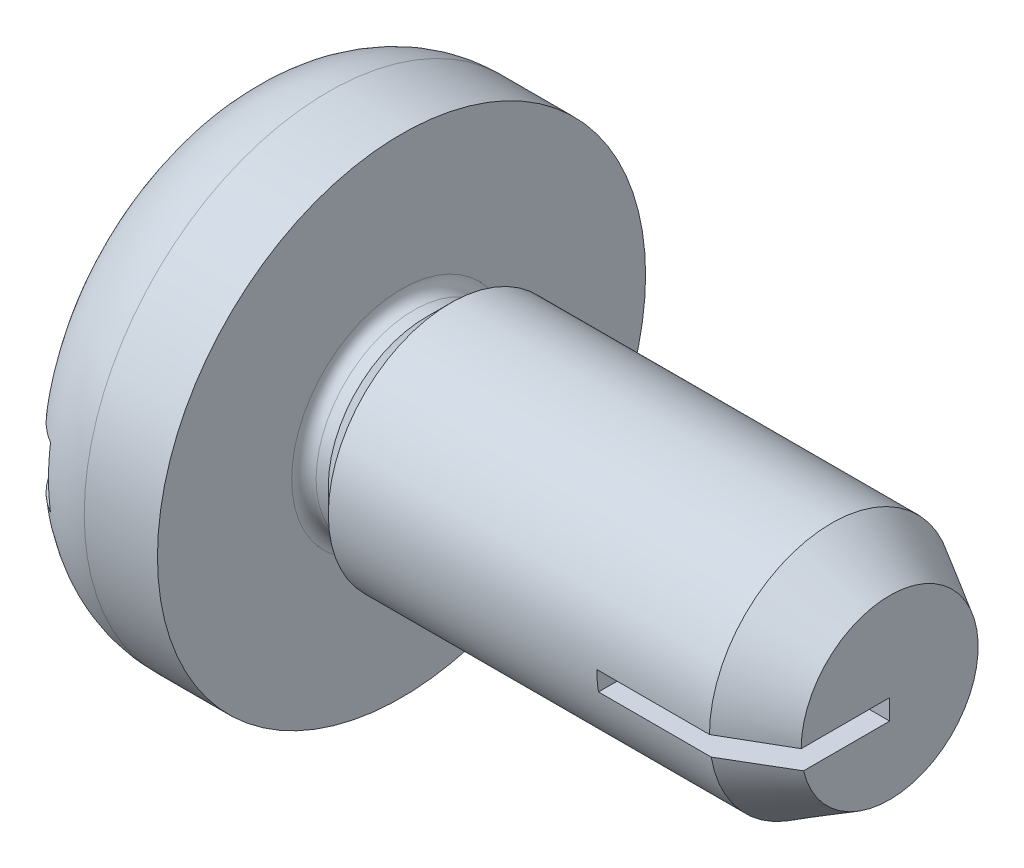
ISO-10303-21;
HEADER;
FILE_DESCRIPTION(('STEP AP214'),'2;1');
FILE_NAME('part.step','',(''),(''),'','','');
FILE_SCHEMA(('AUTOMOTIVE_DESIGN { 1 0 10303 214 1 1 1 1 }'));
ENDSEC;
DATA;
#1=APPLICATION_CONTEXT('core data for automotive mechanical design processes');
#2=APPLICATION_PROTOCOL_DEFINITION('international standard','automotive_design',2000,#1);
#3=PRODUCT_CONTEXT('',#1,'mechanical');
#4=PRODUCT('Part','Part','',(#3));
#5=PRODUCT_RELATED_PRODUCT_CATEGORY('part','',(#4));
#6=PRODUCT_DEFINITION_FORMATION('','',#4);
#7=PRODUCT_DEFINITION_CONTEXT('part definition',#1,'design');
#8=PRODUCT_DEFINITION('design','',#6,#7);
#9=PRODUCT_DEFINITION_SHAPE('','',#8);
#10=(LENGTH_UNIT() NAMED_UNIT(*) SI_UNIT(.MILLI.,.METRE.));
#11=(NAMED_UNIT(*) PLANE_ANGLE_UNIT() SI_UNIT($,.RADIAN.));
#12=(NAMED_UNIT(*) SI_UNIT($,.STERADIAN.) SOLID_ANGLE_UNIT());
#13=UNCERTAINTY_MEASURE_WITH_UNIT(LENGTH_MEASURE(1.E-05),#10,'distance_accuracy_value','');
#14=(GEOMETRIC_REPRESENTATION_CONTEXT(3) GLOBAL_UNCERTAINTY_ASSIGNED_CONTEXT((#13)) GLOBAL_UNIT_ASSIGNED_CONTEXT((#10,
#11,#12)) REPRESENTATION_CONTEXT('',''));
#15=CARTESIAN_POINT('',(0.,0.,0.));
#16=DIRECTION('',(0.,0.,1.));
#17=DIRECTION('',(1.,0.,0.));
#18=AXIS2_PLACEMENT_3D('',#15,#16,#17);
#19=CARTESIAN_POINT('',(0.,0.,0.));
#20=DIRECTION('',(-1.,0.,0.));
#21=DIRECTION('',(0.,0.,1.));
#22=AXIS2_PLACEMENT_3D('',#19,#20,#21);
#23=CYLINDRICAL_SURFACE('',#22,1.);
#24=CARTESIAN_POINT('',(1.8,0.,0.));
#25=DIRECTION('',(-1.,0.,0.));
#26=DIRECTION('',(0.,0.,1.));
#27=AXIS2_PLACEMENT_3D('',#24,#25,#26);
#28=CIRCLE('',#27,1.);
#29=CARTESIAN_POINT('',(1.8,0.,1.));
#30=VERTEX_POINT('',#29);
#31=EDGE_CURVE('E172',#30,#30,#28,.T.);
#32=ORIENTED_EDGE('',*,*,#31,.F.);
#33=EDGE_LOOP('',(#32));
#34=FACE_BOUND('',#33,.T.);
#35=DIRECTION('',(-1.,0.,0.));
#36=VECTOR('',#35,1.);
#37=CARTESIAN_POINT('',(0.,0.,1.));
#38=LINE('',#37,#36);
#39=CARTESIAN_POINT('',(4.92368602791855,0.,1.));
#40=VERTEX_POINT('',#39);
#41=CARTESIAN_POINT('',(4.,0.,1.));
#42=VERTEX_POINT('',#41);
#43=EDGE_CURVE('E257',#40,#42,#38,.T.);
#44=ORIENTED_EDGE('',*,*,#43,.F.);
#45=CARTESIAN_POINT('',(4.92368602791855,0.,0.));
#46=DIRECTION('',(-1.,0.,0.));
#47=DIRECTION('',(0.,0.,1.));
#48=AXIS2_PLACEMENT_3D('',#45,#46,#47);
#49=CIRCLE('',#48,1.);
#50=CARTESIAN_POINT('',(4.92368602791855,-0.166666666666667,0.98601329718327));
#51=VERTEX_POINT('',#50);
#52=EDGE_CURVE('E254',#40,#51,#49,.T.);
#53=ORIENTED_EDGE('',*,*,#52,.T.);
#54=DIRECTION('',(-1.,0.,0.));
#55=VECTOR('',#54,1.);
#56=CARTESIAN_POINT('',(0.,-0.166666666666667,0.98601329718327));
#57=LINE('',#56,#55);
#58=CARTESIAN_POINT('',(4.,-0.166666666666667,0.98601329718327));
#59=VERTEX_POINT('',#58);
#60=EDGE_CURVE('E261',#59,#51,#57,.F.);
#61=ORIENTED_EDGE('',*,*,#60,.F.);
#62=CARTESIAN_POINT('',(4.,0.,0.));
#63=DIRECTION('',(1.,0.,0.));
#64=DIRECTION('',(0.,0.,-1.));
#65=AXIS2_PLACEMENT_3D('',#62,#63,#64);
#66=CIRCLE('',#65,1.);
#67=EDGE_CURVE('E43',#42,#59,#66,.T.);
#68=ORIENTED_EDGE('',*,*,#67,.F.);
#69=EDGE_LOOP('',(#44,#53,#61,#68));
#70=FACE_BOUND('',#69,.T.);
#71=ADVANCED_FACE('F70',(#34,#70),#23,.T.);
#72=CARTESIAN_POINT('',(4.92368602791855,0.,0.));
#73=DIRECTION('',(-1.,0.,0.));
#74=DIRECTION('',(0.,0.,1.));
#75=AXIS2_PLACEMENT_3D('',#72,#73,#74);
#76=CONICAL_SURFACE('',#75,1.,0.523598775598292);
#77=ORIENTED_EDGE('',*,*,#52,.F.);
#78=DIRECTION('',(-0.866025403784442,0.,0.499999999999994));
#79=VECTOR('',#78,1.);
#80=CARTESIAN_POINT('',(6.65573683548745,0.,0.));
#81=LINE('',#80,#79);
#82=CARTESIAN_POINT('',(5.4,0.,0.725));
#83=VERTEX_POINT('',#82);
#84=EDGE_CURVE('E259',#40,#83,#81,.F.);
#85=ORIENTED_EDGE('',*,*,#84,.T.);
#86=CARTESIAN_POINT('',(5.4,0.,0.));
#87=DIRECTION('',(-1.,0.,0.));
#88=DIRECTION('',(0.,0.,1.));
#89=AXIS2_PLACEMENT_3D('',#86,#87,#88);
#90=CIRCLE('',#89,0.725);
#91=CARTESIAN_POINT('',(5.4,-0.166666666666667,0.705582895358315));
#92=VERTEX_POINT('',#91);
#93=EDGE_CURVE('E159',#83,#92,#90,.T.);
#94=ORIENTED_EDGE('',*,*,#93,.T.);
#95=CARTESIAN_POINT('',(6.20158381332156,-0.166666666666667,0.202420053526557));
#96=CARTESIAN_POINT('',(6.18988783202904,-0.166666666666667,0.211160466548662));
#97=CARTESIAN_POINT('',(6.17809025351935,-0.166666666666667,0.219762178615645));
#98=CARTESIAN_POINT('',(6.15433894019539,-0.166666666666667,0.236744395333112));
#99=CARTESIAN_POINT('',(6.14238522545202,-0.166666666666667,0.24512492800532));
#100=CARTESIAN_POINT('',(6.10636354341486,-0.166666666666667,0.27001702074862));
#101=CARTESIAN_POINT('',(6.08212753980992,-0.166666666666667,0.286284562967419));
#102=CARTESIAN_POINT('',(6.03340179258793,-0.166666666666667,0.318405310598194));
#103=CARTESIAN_POINT('',(6.00891218022306,-0.166666666666667,0.334258716708567));
#104=CARTESIAN_POINT('',(5.95975519749879,-0.166666666666667,0.365692570195777));
#105=CARTESIAN_POINT('',(5.93508780915903,-0.166666666666667,0.381272989399869));
#106=CARTESIAN_POINT('',(5.86393910946449,-0.166666666666667,0.425830715171768));
#107=CARTESIAN_POINT('',(5.81730791747779,-0.166666666666667,0.454568202998024));
#108=CARTESIAN_POINT('',(5.72381363437533,-0.166666666666667,0.511663876308538));
#109=CARTESIAN_POINT('',(5.67695053810779,-0.166666666666667,0.540022053314042));
#110=CARTESIAN_POINT('',(5.53610967036876,-0.166666666666667,0.624768530387811));
#111=CARTESIAN_POINT('',(5.44192005634867,-0.166666666666667,0.680804321809171));
#112=CARTESIAN_POINT('',(5.20311464815558,-0.166666666666667,0.822157213235217));
#113=CARTESIAN_POINT('',(5.0583320552326,-0.166666666666667,0.907191272129434));
#114=CARTESIAN_POINT('',(4.8410388744482,-0.166666666666667,1.03439645779868));
#115=CARTESIAN_POINT('',(4.76861884543354,-0.166666666666667,1.07672255711247));
#116=CARTESIAN_POINT('',(4.62373306050023,-0.166666666666667,1.16129606629588));
#117=CARTESIAN_POINT('',(4.55126730468176,-0.166666666666667,1.2035434763371));
#118=CARTESIAN_POINT('',(4.47878578161591,-0.166666666666667,1.24576382962675));
#119=B_SPLINE_CURVE_WITH_KNOTS('',3,(#95,#96,#97,#98,#99,#100,#101,#102,#103,#104,#105,#106,
#107,#108,#109,#110,#111,#112,#113,#114,#115,#116,#117,#118),.UNSPECIFIED.,.F.,.F.,(4,2,2,2,2,2,
2,2,2,2,2,4),(0.,0.0437997583052362,0.0875939406187669,0.175154441441493,0.262671690481115,
0.35019791888352,0.514519420031464,0.678844588147894,1.00763489196675,1.51135489439912,
1.7630003291903,2.01464521454735),.UNSPECIFIED.);
#120=EDGE_CURVE('E263',#92,#51,#119,.T.);
#121=ORIENTED_EDGE('',*,*,#120,.T.);
#122=EDGE_LOOP('',(#77,#85,#94,#121));
#123=FACE_BOUND('',#122,.T.);
#124=ADVANCED_FACE('F219',(#123),#76,.T.);
#125=CARTESIAN_POINT('',(5.4,1.,0.));
#126=DIRECTION('',(-1.,0.,0.));
#127=DIRECTION('',(0.,0.,1.));
#128=AXIS2_PLACEMENT_3D('',#125,#126,#127);
#129=PLANE('',#128);
#130=DIRECTION('',(0.,0.,1.));
#131=VECTOR('',#130,1.);
#132=CARTESIAN_POINT('',(5.4,0.,0.));
#133=LINE('',#132,#131);
#134=CARTESIAN_POINT('',(5.4,0.,0.));
#135=VERTEX_POINT('',#134);
#136=EDGE_CURVE('E78',#135,#83,#133,.T.);
#137=ORIENTED_EDGE('',*,*,#136,.F.);
#138=DIRECTION('',(0.,1.,0.));
#139=VECTOR('',#138,1.);
#140=CARTESIAN_POINT('',(5.4,0.,0.));
#141=LINE('',#140,#139);
#142=CARTESIAN_POINT('',(5.4,-0.166666666666667,0.));
#143=VERTEX_POINT('',#142);
#144=EDGE_CURVE('E150',#143,#135,#141,.T.);
#145=ORIENTED_EDGE('',*,*,#144,.F.);
#146=DIRECTION('',(0.,0.,-1.));
#147=VECTOR('',#146,1.);
#148=CARTESIAN_POINT('',(5.4,-0.166666666666667,0.));
#149=LINE('',#148,#147);
#150=EDGE_CURVE('E160',#92,#143,#149,.T.);
#151=ORIENTED_EDGE('',*,*,#150,.F.);
#152=ORIENTED_EDGE('',*,*,#93,.F.);
#153=EDGE_LOOP('',(#137,#145,#151,#152));
#154=FACE_BOUND('',#153,.T.);
#155=ADVANCED_FACE('F72',(#154),#129,.F.);
#156=CARTESIAN_POINT('',(0.,0.,0.));
#157=DIRECTION('',(1.,0.,0.));
#158=DIRECTION('',(0.,0.,-1.));
#159=AXIS2_PLACEMENT_3D('',#156,#157,#158);
#160=PLANE('',#159);
#161=CARTESIAN_POINT('',(0.,0.,0.));
#162=DIRECTION('',(-1.,0.,0.));
#163=DIRECTION('',(0.,0.,1.));
#164=AXIS2_PLACEMENT_3D('',#161,#162,#163);
#165=CIRCLE('',#164,1.2);
#166=CARTESIAN_POINT('',(0.,0.25,1.17366945943055));
#167=VERTEX_POINT('',#166);
#168=CARTESIAN_POINT('',(0.,0.25,-1.17366945943055));
#169=VERTEX_POINT('',#168);
#170=EDGE_CURVE('E190',#167,#169,#165,.T.);
#171=ORIENTED_EDGE('',*,*,#170,.T.);
#172=DIRECTION('',(0.,0.,1.));
#173=VECTOR('',#172,1.);
#174=CARTESIAN_POINT('',(0.,0.25,0.));
#175=LINE('',#174,#173);
#176=EDGE_CURVE('E167',#169,#167,#175,.T.);
#177=ORIENTED_EDGE('',*,*,#176,.T.);
#178=EDGE_LOOP('',(#171,#177));
#179=FACE_BOUND('',#178,.T.);
#180=ADVANCED_FACE('F296',(#179),#160,.F.);
#181=CARTESIAN_POINT('',(1.8,0.,0.));
#182=DIRECTION('',(1.,0.,0.));
#183=DIRECTION('',(0.,0.,-1.));
#184=AXIS2_PLACEMENT_3D('',#181,#182,#183);
#185=CONICAL_SURFACE('',#184,1.,0.785398163397449);
#186=CARTESIAN_POINT('',(1.6,0.,0.));
#187=DIRECTION('',(-1.,0.,0.));
#188=DIRECTION('',(0.,0.,1.));
#189=AXIS2_PLACEMENT_3D('',#186,#187,#188);
#190=CIRCLE('',#189,0.800000000000001);
#191=CARTESIAN_POINT('',(1.6,0.,0.800000000000001));
#192=VERTEX_POINT('',#191);
#193=EDGE_CURVE('E175',#192,#192,#190,.T.);
#194=ORIENTED_EDGE('',*,*,#193,.F.);
#195=EDGE_LOOP('',(#194));
#196=FACE_BOUND('',#195,.T.);
#197=ORIENTED_EDGE('',*,*,#31,.T.);
#198=EDGE_LOOP('',(#197));
#199=FACE_BOUND('',#198,.T.);
#200=ADVANCED_FACE('F292',(#196,#199),#185,.T.);
#201=CARTESIAN_POINT('',(0.,0.,0.));
#202=DIRECTION('',(-1.,0.,0.));
#203=DIRECTION('',(0.,0.,1.));
#204=AXIS2_PLACEMENT_3D('',#201,#202,#203);
#205=CYLINDRICAL_SURFACE('',#204,0.800000000000001);
#206=CARTESIAN_POINT('',(1.5,0.,0.));
#207=DIRECTION('',(-1.,0.,0.));
#208=DIRECTION('',(0.,0.,1.));
#209=AXIS2_PLACEMENT_3D('',#206,#207,#208);
#210=CIRCLE('',#209,0.800000000000001);
#211=CARTESIAN_POINT('',(1.5,0.,0.800000000000001));
#212=VERTEX_POINT('',#211);
#213=EDGE_CURVE('E178',#212,#212,#210,.T.);
#214=ORIENTED_EDGE('',*,*,#213,.F.);
#215=EDGE_LOOP('',(#214));
#216=FACE_BOUND('',#215,.T.);
#217=ORIENTED_EDGE('',*,*,#193,.T.);
#218=EDGE_LOOP('',(#217));
#219=FACE_BOUND('',#218,.T.);
#220=ADVANCED_FACE('F295',(#216,#219),#205,.T.);
#221=CARTESIAN_POINT('',(1.5,0.,0.));
#222=DIRECTION('',(-1.,0.,0.));
#223=DIRECTION('',(0.,0.,1.));
#224=AXIS2_PLACEMENT_3D('',#221,#222,#223);
#225=TOROIDAL_SURFACE('',#224,0.900000000000001,0.1);
#226=CARTESIAN_POINT('',(1.4,0.,0.));
#227=DIRECTION('',(-1.,0.,0.));
#228=DIRECTION('',(0.,0.,1.));
#229=AXIS2_PLACEMENT_3D('',#226,#227,#228);
#230=CIRCLE('',#229,0.900000000000001);
#231=CARTESIAN_POINT('',(1.4,0.,0.900000000000001));
#232=VERTEX_POINT('',#231);
#233=EDGE_CURVE('E181',#232,#232,#230,.T.);
#234=ORIENTED_EDGE('',*,*,#233,.F.);
#235=EDGE_LOOP('',(#234));
#236=FACE_BOUND('',#235,.T.);
#237=ORIENTED_EDGE('',*,*,#213,.T.);
#238=EDGE_LOOP('',(#237));
#239=FACE_BOUND('',#238,.T.);
#240=ADVANCED_FACE('F300',(#236,#239),#225,.F.);
#241=CARTESIAN_POINT('',(1.4,2.,0.));
#242=DIRECTION('',(-1.,0.,0.));
#243=DIRECTION('',(0.,0.,1.));
#244=AXIS2_PLACEMENT_3D('',#241,#242,#243);
#245=PLANE('',#244);
#246=CARTESIAN_POINT('',(1.4,0.,0.));
#247=DIRECTION('',(-1.,0.,0.));
#248=DIRECTION('',(0.,0.,1.));
#249=AXIS2_PLACEMENT_3D('',#246,#247,#248);
#250=CIRCLE('',#249,2.);
#251=CARTESIAN_POINT('',(1.4,0.,2.));
#252=VERTEX_POINT('',#251);
#253=EDGE_CURVE('E184',#252,#252,#250,.T.);
#254=ORIENTED_EDGE('',*,*,#253,.F.);
#255=EDGE_LOOP('',(#254));
#256=FACE_BOUND('',#255,.T.);
#257=ORIENTED_EDGE('',*,*,#233,.T.);
#258=EDGE_LOOP('',(#257));
#259=FACE_BOUND('',#258,.T.);
#260=ADVANCED_FACE('F304',(#256,#259),#245,.F.);
#261=CARTESIAN_POINT('',(0.,0.,0.));
#262=DIRECTION('',(-1.,0.,0.));
#263=DIRECTION('',(0.,0.,1.));
#264=AXIS2_PLACEMENT_3D('',#261,#262,#263);
#265=CYLINDRICAL_SURFACE('',#264,2.);
#266=CARTESIAN_POINT('',(0.8,0.,0.));
#267=DIRECTION('',(-1.,0.,0.));
#268=DIRECTION('',(0.,0.,1.));
#269=AXIS2_PLACEMENT_3D('',#266,#267,#268);
#270=CIRCLE('',#269,2.);
#271=CARTESIAN_POINT('',(0.8,0.,2.));
#272=VERTEX_POINT('',#271);
#273=EDGE_CURVE('E187',#272,#272,#270,.T.);
#274=ORIENTED_EDGE('',*,*,#273,.F.);
#275=EDGE_LOOP('',(#274));
#276=FACE_BOUND('',#275,.T.);
#277=ORIENTED_EDGE('',*,*,#253,.T.);
#278=EDGE_LOOP('',(#277));
#279=FACE_BOUND('',#278,.T.);
#280=ADVANCED_FACE('F307',(#276,#279),#265,.T.);
#281=CARTESIAN_POINT('',(0.8,0.,0.));
#282=DIRECTION('',(-1.,0.,0.));
#283=DIRECTION('',(0.,0.,1.));
#284=AXIS2_PLACEMENT_3D('',#281,#282,#283);
#285=TOROIDAL_SURFACE('',#284,1.2,0.8);
#286=CARTESIAN_POINT('',(0.4,0.,0.));
#287=DIRECTION('',(1.,0.,0.));
#288=DIRECTION('',(0.,0.,-1.));
#289=AXIS2_PLACEMENT_3D('',#286,#287,#288);
#290=CIRCLE('',#289,1.89282032302755);
#291=CARTESIAN_POINT('',(0.4,-0.25,-1.87623793141119));
#292=VERTEX_POINT('',#291);
#293=CARTESIAN_POINT('',(0.4,0.25,-1.87623793141119));
#294=VERTEX_POINT('',#293);
#295=EDGE_CURVE('E161',#292,#294,#290,.T.);
#296=ORIENTED_EDGE('',*,*,#295,.T.);
#297=CARTESIAN_POINT('',(0.297641513114728,0.25,-1.80537695650918));
#298=CARTESIAN_POINT('',(0.262528568994835,0.25,-1.77677347833337));
#299=CARTESIAN_POINT('',(0.229840551338113,0.25,-1.74516967180868));
#300=CARTESIAN_POINT('',(0.170246522961208,0.25,-1.67689481820457));
#301=CARTESIAN_POINT('',(0.143343796832417,0.25,-1.64022091189131));
#302=CARTESIAN_POINT('',(0.0960803904188592,0.25,-1.56291214109144));
#303=CARTESIAN_POINT('',(0.0757150990563475,0.25,-1.52228009490094));
#304=CARTESIAN_POINT('',(0.0420229536584969,0.25,-1.43820539537305));
#305=CARTESIAN_POINT('',(0.0286953895823237,0.25,-1.39476302606757));
#306=CARTESIAN_POINT('',(0.00927226084332459,0.25,-1.30583059326195));
#307=CARTESIAN_POINT('',(0.00325152163653898,0.25,-1.26032421380896));
#308=CARTESIAN_POINT('',(-0.00124079473979117,0.25,-1.16894269333466));
#309=CARTESIAN_POINT('',(0.000288478374437018,0.25,-1.1230675113596));
#310=CARTESIAN_POINT('',(0.0108564474233976,0.25,-1.03114578944601));
#311=CARTESIAN_POINT('',(0.0200635714534037,0.25,-0.985118679443079));
#312=CARTESIAN_POINT('',(0.0458073827056344,0.25,-0.895172079189981));
#313=CARTESIAN_POINT('',(0.062344411580712,0.25,-0.851252687288039));
#314=CARTESIAN_POINT('',(0.102869578488189,0.25,-0.765088594240687));
#315=CARTESIAN_POINT('',(0.127101154371767,0.25,-0.722958514109644));
#316=CARTESIAN_POINT('',(0.182008910039328,0.25,-0.64310701476855));
#317=CARTESIAN_POINT('',(0.212689120228319,0.25,-0.605388375770312));
#318=CARTESIAN_POINT('',(0.281145178492664,0.25,-0.533674961383132));
#319=CARTESIAN_POINT('',(0.319180231788253,0.25,-0.499927491723283));
#320=CARTESIAN_POINT('',(0.400405819924513,0.25,-0.439282651032787));
#321=CARTESIAN_POINT('',(0.443595673356768,0.25,-0.412384376082953));
#322=CARTESIAN_POINT('',(0.524199535384849,0.25,-0.371963243936569));
#323=CARTESIAN_POINT('',(0.560789679582939,0.25,-0.356799189964425));
#324=CARTESIAN_POINT('',(0.635915028523429,0.25,-0.332640332370351));
#325=CARTESIAN_POINT('',(0.674445424973741,0.25,-0.323631013019252));
#326=CARTESIAN_POINT('',(0.75283454722965,0.25,-0.312802217467384));
#327=CARTESIAN_POINT('',(0.79270101110683,0.25,-0.311036617030238));
#328=CARTESIAN_POINT('',(0.872050829186862,0.25,-0.315141452463768));
#329=CARTESIAN_POINT('',(0.911533913767451,0.25,-0.321016918439192));
#330=CARTESIAN_POINT('',(0.984956151872345,0.25,-0.338602740495633));
#331=CARTESIAN_POINT('',(1.01905524508013,0.25,-0.349671980357059));
#332=CARTESIAN_POINT('',(1.08538658771039,0.25,-0.376426243530606));
#333=CARTESIAN_POINT('',(1.11761769552715,0.25,-0.392114054578179));
#334=CARTESIAN_POINT('',(1.18587541780915,0.25,-0.430841532289609));
#335=CARTESIAN_POINT('',(1.22142783898769,0.25,-0.454716663564961));
#336=CARTESIAN_POINT('',(1.28880421290546,0.25,-0.507243688877895));
#337=CARTESIAN_POINT('',(1.32062652135053,0.25,-0.535897676128736));
#338=CARTESIAN_POINT('',(1.38514769867315,0.25,-0.602737189966404));
#339=CARTESIAN_POINT('',(1.41703390559919,0.25,-0.641713600786842));
#340=CARTESIAN_POINT('',(1.47390688910545,0.25,-0.72442589159771));
#341=CARTESIAN_POINT('',(1.49889211468468,0.25,-0.76816283844815));
#342=CARTESIAN_POINT('',(1.54131119074003,0.25,-0.85977913253978));
#343=CARTESIAN_POINT('',(1.55865610458618,0.25,-0.907699865548958));
#344=CARTESIAN_POINT('',(1.58463360886963,0.25,-1.00585023952778));
#345=CARTESIAN_POINT('',(1.59326811427821,0.25,-1.05607937045931));
#346=CARTESIAN_POINT('',(1.60118974677304,0.25,-1.15501761225336));
#347=CARTESIAN_POINT('',(1.60087599601291,0.25,-1.20369480751589));
#348=CARTESIAN_POINT('',(1.59175566556494,0.25,-1.30024852684206));
#349=CARTESIAN_POINT('',(1.58295084652309,0.25,-1.34812521479936));
#350=CARTESIAN_POINT('',(1.55749591072722,0.25,-1.4398603029324));
#351=CARTESIAN_POINT('',(1.54114406412434,0.25,-1.48380159837298));
#352=CARTESIAN_POINT('',(1.50113081277985,0.25,-1.56822026333492));
#353=CARTESIAN_POINT('',(1.47747041005489,0.25,-1.60869810673112));
#354=CARTESIAN_POINT('',(1.42410126900036,0.25,-1.6841006375666));
#355=CARTESIAN_POINT('',(1.39453834580358,0.25,-1.71912859314433));
#356=CARTESIAN_POINT('',(1.32988284912281,0.25,-1.78364341448841));
#357=CARTESIAN_POINT('',(1.29479069758761,0.25,-1.81313070270032));
#358=CARTESIAN_POINT('',(1.22056311968849,0.25,-1.86534196797625));
#359=CARTESIAN_POINT('',(1.18148498904368,0.25,-1.8881474315636));
#360=CARTESIAN_POINT('',(1.10003534670814,0.25,-1.92682097672895));
#361=CARTESIAN_POINT('',(1.05766402277243,0.25,-1.94268945346456));
#362=CARTESIAN_POINT('',(0.971147634732373,0.25,-1.96693488689356));
#363=CARTESIAN_POINT('',(0.927016906006012,0.25,-1.97536302385428));
#364=CARTESIAN_POINT('',(0.837961663131307,0.25,-1.98466804680843));
#365=CARTESIAN_POINT('',(0.793037085466104,0.25,-1.98554432580175));
#366=CARTESIAN_POINT('',(0.703801857898337,0.25,-1.97972715220462));
#367=CARTESIAN_POINT('',(0.659489904538705,0.25,-1.97305359325104));
#368=CARTESIAN_POINT('',(0.572631875580185,0.25,-1.95236457221099));
#369=CARTESIAN_POINT('',(0.530084887700166,0.25,-1.93835295538806));
#370=CARTESIAN_POINT('',(0.454622185850731,0.25,-1.90624903176719));
#371=CARTESIAN_POINT('',(0.421263538118282,0.25,-1.88918702914212));
#372=CARTESIAN_POINT('',(0.357266226363612,0.25,-1.85055727056724));
#373=CARTESIAN_POINT('',(0.326627615446452,0.25,-1.8289894266745));
#374=CARTESIAN_POINT('',(0.297641513114728,0.25,-1.80537695650918));
#375=B_SPLINE_CURVE_WITH_KNOTS('',3,(#297,#298,#299,#300,#301,#302,#303,#304,#305,#306,#307,
#308,#309,#310,#311,#312,#313,#314,#315,#316,#317,#318,#319,#320,#321,#322,#323,#324,#325,#326,
#327,#328,#329,#330,#331,#332,#333,#334,#335,#336,#337,#338,#339,#340,#341,#342,#343,#344,#345,
#346,#347,#348,#349,#350,#351,#352,#353,#354,#355,#356,#357,#358,#359,#360,#361,#362,#363,#364,
#365,#366,#367,#368,#369,#370,#371,#372,#373,#374),.UNSPECIFIED.,.T.,.F.,(4,2,2,2,2,2,2,2,2,2,2,
2,2,2,2,2,2,2,2,2,2,2,2,2,2,2,2,2,2,2,2,2,2,2,2,2,2,2,4),(0.,0.13573068980661,0.27153823825717,
0.407249785415933,0.54294763793212,0.68002368499452,0.817115169938618,0.957295640360665,
1.09748264539617,1.24264102487973,1.38789039975923,1.53974421450601,1.69157797801922,
1.80996059649222,1.9280630407188,2.04704230671929,2.16609993628684,2.2732709541145,
2.380506792666,2.50851522183137,2.63657986865134,2.78694949416294,2.93735288791698,
3.08946354291701,3.24154074930668,3.38684587015214,3.53212086806424,3.67209013552936,
3.81204022145833,3.94888575592272,4.0857208524267,4.22081021259061,4.35589187653908,
4.49003693941525,4.62419278444728,4.75799595381838,4.89172907817093,5.00377399406435,
5.11582109700326),.UNSPECIFIED.);
#376=EDGE_CURVE('E194',#294,#169,#375,.T.);
#377=ORIENTED_EDGE('',*,*,#376,.T.);
#378=ORIENTED_EDGE('',*,*,#170,.F.);
#379=CARTESIAN_POINT('',(0.301438981929367,0.25,0.51708688904725));
#380=CARTESIAN_POINT('',(0.263056054445237,0.25,0.551061767453975));
#381=CARTESIAN_POINT('',(0.22751295839954,0.25,0.58829869772527));
#382=CARTESIAN_POINT('',(0.163158590378439,0.25,0.668248028829589));
#383=CARTESIAN_POINT('',(0.134354778200934,0.25,0.71096641695652));
#384=CARTESIAN_POINT('',(0.0846290207801832,0.25,0.800523344560777));
#385=CARTESIAN_POINT('',(0.063670717909773,0.25,0.847341605897098));
#386=CARTESIAN_POINT('',(0.0303032713553611,0.25,0.943919509288068));
#387=CARTESIAN_POINT('',(0.0178897208388618,0.25,0.993677620757679));
#388=CARTESIAN_POINT('',(0.00251206941526227,0.25,1.09253892487983));
#389=CARTESIAN_POINT('',(-0.000819633501285088,0.25,1.14158490177727));
#390=CARTESIAN_POINT('',(0.00116045780609703,0.25,1.23950753078401));
#391=CARTESIAN_POINT('',(0.00647097974825989,0.25,1.28838420675576));
#392=CARTESIAN_POINT('',(0.0253031431075936,0.25,1.38250516510713));
#393=CARTESIAN_POINT('',(0.0384898681442895,0.25,1.42781660300287));
#394=CARTESIAN_POINT('',(0.0724761244540768,0.25,1.51548841016115));
#395=CARTESIAN_POINT('',(0.0932743853133254,0.25,1.55784927049025));
#396=CARTESIAN_POINT('',(0.141308414608921,0.25,1.63731438510273));
#397=CARTESIAN_POINT('',(0.168371732112361,0.25,1.67452295338737));
#398=CARTESIAN_POINT('',(0.228445080616735,0.25,1.74378290420902));
#399=CARTESIAN_POINT('',(0.261454608260194,0.25,1.77583472283981));
#400=CARTESIAN_POINT('',(0.331961575426119,0.25,1.83339635403335));
#401=CARTESIAN_POINT('',(0.369387649171914,0.25,1.85899361670184));
#402=CARTESIAN_POINT('',(0.448033221092068,0.25,1.9034825999414));
#403=CARTESIAN_POINT('',(0.489252534823172,0.25,1.9223746463315));
#404=CARTESIAN_POINT('',(0.573960681844302,0.25,1.95277072514197));
#405=CARTESIAN_POINT('',(0.617428933797755,0.25,1.96433213702624));
#406=CARTESIAN_POINT('',(0.705691968241025,0.25,1.97996385561481));
#407=CARTESIAN_POINT('',(0.750486717387926,0.25,1.98403435044912));
#408=CARTESIAN_POINT('',(0.839959190569346,0.25,1.98456387317015));
#409=CARTESIAN_POINT('',(0.884636755521996,0.25,1.98105024339638));
#410=CARTESIAN_POINT('',(0.97276686477517,0.25,1.96657016949891));
#411=CARTESIAN_POINT('',(1.01621941875048,0.25,1.95560378425213));
#412=CARTESIAN_POINT('',(1.1006609957549,0.25,1.92654084691793));
#413=CARTESIAN_POINT('',(1.14165047160955,0.25,1.90844561008768));
#414=CARTESIAN_POINT('',(1.2200222183655,0.25,1.86565105020625));
#415=CARTESIAN_POINT('',(1.25740446581955,0.25,1.84095168423167));
#416=CARTESIAN_POINT('',(1.32763387977652,0.25,1.78557518870616));
#417=CARTESIAN_POINT('',(1.36046635187505,0.25,1.75487942793931));
#418=CARTESIAN_POINT('',(1.42055531743583,0.25,1.68844648977335));
#419=CARTESIAN_POINT('',(1.44781168184685,0.25,1.65270919572733));
#420=CARTESIAN_POINT('',(1.49619759007541,0.25,1.57694002659125));
#421=CARTESIAN_POINT('',(1.51728150357713,0.25,1.53687902271412));
#422=CARTESIAN_POINT('',(1.55251920024155,0.25,1.45381993425269));
#423=CARTESIAN_POINT('',(1.56667271519789,0.25,1.41082173607236));
#424=CARTESIAN_POINT('',(1.5878658457172,0.25,1.32251834699103));
#425=CARTESIAN_POINT('',(1.59481084118682,0.25,1.27719047206641));
#426=CARTESIAN_POINT('',(1.60116279004571,0.25,1.18601279374499));
#427=CARTESIAN_POINT('',(1.6005690452397,0.25,1.14016294239859));
#428=CARTESIAN_POINT('',(1.59187946678489,0.25,1.048173028637));
#429=CARTESIAN_POINT('',(1.58362021215185,0.25,1.00204846535137));
#430=CARTESIAN_POINT('',(1.55973683653611,0.25,0.911756113605458));
#431=CARTESIAN_POINT('',(1.54411224595579,0.25,0.867588450109274));
#432=CARTESIAN_POINT('',(1.50540058896639,0.25,0.780816395723917));
#433=CARTESIAN_POINT('',(1.48207400315254,0.25,0.738318986388612));
#434=CARTESIAN_POINT('',(1.42890814967534,0.25,0.657597467923709));
#435=CARTESIAN_POINT('',(1.39906545346147,0.25,0.619375624519988));
#436=CARTESIAN_POINT('',(1.33224055398873,0.25,0.546493431462282));
#437=CARTESIAN_POINT('',(1.29499534135401,0.25,0.512074168884129));
#438=CARTESIAN_POINT('',(1.21525952344555,0.25,0.449903969475797));
#439=CARTESIAN_POINT('',(1.17276855533905,0.25,0.422153494296718));
#440=CARTESIAN_POINT('',(1.09265863753095,0.25,0.379624237856065));
#441=CARTESIAN_POINT('',(1.05583332692421,0.25,0.363351628970918));
#442=CARTESIAN_POINT('',(0.98006496656622,0.25,0.337003998329631));
#443=CARTESIAN_POINT('',(0.94112698580716,0.25,0.326914799140306));
#444=CARTESIAN_POINT('',(0.861684729129586,0.25,0.31403463071762));
#445=CARTESIAN_POINT('',(0.821170170148787,0.25,0.31130465028534));
#446=CARTESIAN_POINT('',(0.740372410895902,0.25,0.31378718752855));
#447=CARTESIAN_POINT('',(0.700089331984488,0.25,0.319003546849306));
#448=CARTESIAN_POINT('',(0.625760740013713,0.25,0.335526226108912));
#449=CARTESIAN_POINT('',(0.591534155553408,0.25,0.346054894344322));
#450=CARTESIAN_POINT('',(0.52490718500846,0.25,0.371797289972593));
#451=CARTESIAN_POINT('',(0.492507145163851,0.25,0.387011902124301));
#452=CARTESIAN_POINT('',(0.432578905230262,0.25,0.419952251629053));
#453=CARTESIAN_POINT('',(0.404870751562168,0.25,0.437354119192954));
#454=CARTESIAN_POINT('',(0.351536378785399,0.25,0.475090638624462));
#455=CARTESIAN_POINT('',(0.325910504244121,0.25,0.495425774339025));
#456=CARTESIAN_POINT('',(0.301438981929367,0.25,0.51708688904725));
#457=B_SPLINE_CURVE_WITH_KNOTS('',3,(#379,#380,#381,#382,#383,#384,#385,#386,#387,#388,#389,
#390,#391,#392,#393,#394,#395,#396,#397,#398,#399,#400,#401,#402,#403,#404,#405,#406,#407,#408,
#409,#410,#411,#412,#413,#414,#415,#416,#417,#418,#419,#420,#421,#422,#423,#424,#425,#426,#427,
#428,#429,#430,#431,#432,#433,#434,#435,#436,#437,#438,#439,#440,#441,#442,#443,#444,#445,#446,
#447,#448,#449,#450,#451,#452,#453,#454,#455,#456),.UNSPECIFIED.,.T.,.F.,(4,2,2,2,2,2,2,2,2,2,2,
2,2,2,2,2,2,2,2,2,2,2,2,2,2,2,2,2,2,2,2,2,2,2,2,2,2,2,4),(0.,0.153660893038154,
0.307491078956015,0.460599291145708,0.61362848070608,0.760364562620453,0.90707904445421,
1.0479593582349,1.18881616890915,1.3261795612793,1.46353133104883,1.59890788767835,
1.73427786520587,1.86857473049104,2.0028682229425,2.13667836841926,2.27048745680517,
2.4042718692662,2.53805715127719,2.67226492179544,2.80647579801366,2.94165513830179,
3.07683970961572,3.21377711706224,3.35072720696579,3.49066569611598,3.63061310864354,
3.77540320334185,3.92026966592439,4.07172570733132,4.22319223036191,4.34352715485448,
4.46358513086058,4.58463506012023,4.70574352934999,4.81278641424508,4.91984952244224,
5.01780179813655,5.11577024972073),.UNSPECIFIED.);
#458=CARTESIAN_POINT('',(0.4,0.25,1.87623793141119));
#459=VERTEX_POINT('',#458);
#460=EDGE_CURVE('E202',#167,#459,#457,.T.);
#461=ORIENTED_EDGE('',*,*,#460,.T.);
#462=CARTESIAN_POINT('',(0.4,-0.25,1.87623793141118));
#463=VERTEX_POINT('',#462);
#464=EDGE_CURVE('E164',#459,#463,#290,.T.);
#465=ORIENTED_EDGE('',*,*,#464,.T.);
#466=CARTESIAN_POINT('',(0.301438981929367,-0.25,0.51708688904725));
#467=CARTESIAN_POINT('',(0.338802384909297,-0.25,0.484013405520598));
#468=CARTESIAN_POINT('',(0.378900407247452,-0.25,0.453986408101012));
#469=CARTESIAN_POINT('',(0.463683855684882,-0.25,0.401203325711226));
#470=CARTESIAN_POINT('',(0.508369217569701,-0.25,0.378447138981162));
#471=CARTESIAN_POINT('',(0.589752685332018,-0.25,0.346564075056743));
#472=CARTESIAN_POINT('',(0.625670280523489,-0.25,0.33545459947458));
#473=CARTESIAN_POINT('',(0.698804930191424,-0.25,0.319384208642176));
#474=CARTESIAN_POINT('',(0.736018335997859,-0.25,0.314407270519868));
#475=CARTESIAN_POINT('',(0.810877351359191,-0.25,0.311221373719452));
#476=CARTESIAN_POINT('',(0.848524025373078,-0.25,0.313036468396989));
#477=CARTESIAN_POINT('',(0.922956436221167,-0.25,0.32322617727654));
#478=CARTESIAN_POINT('',(0.959740333328278,-0.25,0.331613690961402));
#479=CARTESIAN_POINT('',(1.03858180590102,-0.25,0.356214966617587));
#480=CARTESIAN_POINT('',(1.08025528244983,-0.25,0.373642758990672));
#481=CARTESIAN_POINT('',(1.16022891698493,-0.25,0.415000709814123));
#482=CARTESIAN_POINT('',(1.19852528000803,-0.25,0.438938062988916));
#483=CARTESIAN_POINT('',(1.27158047334996,-0.25,0.492633662294552));
#484=CARTESIAN_POINT('',(1.30628481222999,-0.25,0.522465850651822));
#485=CARTESIAN_POINT('',(1.37084931182692,-0.25,0.586942788341738));
#486=CARTESIAN_POINT('',(1.40071161312797,-0.25,0.62158539842384));
#487=CARTESIAN_POINT('',(1.45819431133605,-0.25,0.699444429671923));
#488=CARTESIAN_POINT('',(1.48510197358499,-0.25,0.74319115786558));
#489=CARTESIAN_POINT('',(1.53097854811728,-0.25,0.834690863343834));
#490=CARTESIAN_POINT('',(1.54994531542034,-0.25,0.882444918904329));
#491=CARTESIAN_POINT('',(1.57876876915567,-0.25,0.979317655876168));
#492=CARTESIAN_POINT('',(1.58884421767048,-0.25,1.02837105154376));
#493=CARTESIAN_POINT('',(1.60019954182964,-0.25,1.12748448265999));
#494=CARTESIAN_POINT('',(1.60148205334201,-0.25,1.1775442119255));
#495=CARTESIAN_POINT('',(1.59520885531185,-0.25,1.27487717781999));
#496=CARTESIAN_POINT('',(1.5880421292756,-0.25,1.32217562054701));
#497=CARTESIAN_POINT('',(1.56561706002704,-0.25,1.41481530050143));
#498=CARTESIAN_POINT('',(1.55036010093924,-0.25,1.46015687108747));
#499=CARTESIAN_POINT('',(1.51272327397019,-0.25,1.54615001782124));
#500=CARTESIAN_POINT('',(1.49057215928401,-0.25,1.58690181204837));
#501=CARTESIAN_POINT('',(1.43962476785779,-0.25,1.66401572896715));
#502=CARTESIAN_POINT('',(1.41082921651674,-0.25,1.70037833018451));
#503=CARTESIAN_POINT('',(1.34797730088368,-0.25,1.76701038798641));
#504=CARTESIAN_POINT('',(1.31402345764493,-0.25,1.79737659429918));
#505=CARTESIAN_POINT('',(1.2414554885635,-0.25,1.85190772629046));
#506=CARTESIAN_POINT('',(1.20284164629706,-0.25,1.8760730290348));
#507=CARTESIAN_POINT('',(1.12247189893764,-0.25,1.91727225819301));
#508=CARTESIAN_POINT('',(1.08075145487031,-0.25,1.93437538568629));
#509=CARTESIAN_POINT('',(0.995022355351482,-0.25,1.96129414264786));
#510=CARTESIAN_POINT('',(0.951013775084142,-0.25,1.97111001140104));
#511=CARTESIAN_POINT('',(0.862198007098304,-0.25,1.98313410515792));
#512=CARTESIAN_POINT('',(0.817396017295139,-0.25,1.98538075553559));
#513=CARTESIAN_POINT('',(0.728052531748813,-0.25,1.98230862873703));
#514=CARTESIAN_POINT('',(0.683511032427383,-0.25,1.97698995572933));
#515=CARTESIAN_POINT('',(0.596018785853274,-0.25,1.9589559696915));
#516=CARTESIAN_POINT('',(0.553065850122288,-0.25,1.94625126897481));
#517=CARTESIAN_POINT('',(0.46989716240117,-0.25,1.91382377229778));
#518=CARTESIAN_POINT('',(0.429681412231854,-0.25,1.89410097166895));
#519=CARTESIAN_POINT('',(0.353043668485175,-0.25,1.84816691746255));
#520=CARTESIAN_POINT('',(0.316628820904148,-0.25,1.82194374417058));
#521=CARTESIAN_POINT('',(0.248689040701219,-0.25,1.763786920625));
#522=CARTESIAN_POINT('',(0.217164186485919,-0.25,1.73185317882528));
#523=CARTESIAN_POINT('',(0.159702755785032,-0.25,1.66300130997671));
#524=CARTESIAN_POINT('',(0.133798036998669,-0.25,1.62605660327808));
#525=CARTESIAN_POINT('',(0.0884860109652966,-0.25,1.54837916655265));
#526=CARTESIAN_POINT('',(0.0690789687399962,-0.25,1.50764628210343));
#527=CARTESIAN_POINT('',(0.0370773999665859,-0.25,1.42309771497058));
#528=CARTESIAN_POINT('',(0.0245567178926342,-0.25,1.3792541002284));
#529=CARTESIAN_POINT('',(0.00691559631271085,-0.25,1.29010808339342));
#530=CARTESIAN_POINT('',(0.00179525688070171,-0.25,1.2448056615818));
#531=CARTESIAN_POINT('',(-0.00102831063482592,-0.25,1.15316199723278));
#532=CARTESIAN_POINT('',(0.00140273678802212,-0.25,1.10681666508788));
#533=CARTESIAN_POINT('',(0.0137855974792939,-0.25,1.015134712927));
#534=CARTESIAN_POINT('',(0.0237400161514256,-0.25,0.969798447959527));
#535=CARTESIAN_POINT('',(0.0511662791985746,-0.25,0.879987884124796));
#536=CARTESIAN_POINT('',(0.0688531276532085,-0.25,0.835579442073697));
#537=CARTESIAN_POINT('',(0.111120603902977,-0.25,0.750221615998061));
#538=CARTESIAN_POINT('',(0.135695398440748,-0.25,0.709269343033893));
#539=CARTESIAN_POINT('',(0.183329478729157,-0.25,0.64244393107564));
#540=CARTESIAN_POINT('',(0.204941478663946,-0.25,0.61552451417498));
#541=CARTESIAN_POINT('',(0.251078254828263,-0.25,0.564279064961243));
#542=CARTESIAN_POINT('',(0.275604948497551,-0.25,0.539954760038368));
#543=CARTESIAN_POINT('',(0.301438981929367,-0.25,0.51708688904725));
#544=B_SPLINE_CURVE_WITH_KNOTS('',3,(#466,#467,#468,#469,#470,#471,#472,#473,#474,#475,#476,
#477,#478,#479,#480,#481,#482,#483,#484,#485,#486,#487,#488,#489,#490,#491,#492,#493,#494,#495,
#496,#497,#498,#499,#500,#501,#502,#503,#504,#505,#506,#507,#508,#509,#510,#511,#512,#513,#514,
#515,#516,#517,#518,#519,#520,#521,#522,#523,#524,#525,#526,#527,#528,#529,#530,#531,#532,#533,
#534,#535,#536,#537,#538,#539,#540,#541,#542,#543),.UNSPECIFIED.,.T.,.F.,(4,2,2,2,2,2,2,2,2,2,2,
2,2,2,2,2,2,2,2,2,2,2,2,2,2,2,2,2,2,2,2,2,2,2,2,2,2,2,4),(0.,0.149578419735533,
0.299154745929244,0.411499148695781,0.523549395362643,0.635996832537111,0.748665521276607,
0.883474437807059,1.01843296242826,1.15520619806368,1.29191880269483,1.44523491364225,
1.59859241138497,1.748062108282,1.89748699652989,2.04029292348272,2.18307442623925,
2.3215487842163,2.46000803155602,2.59600810182633,2.7319999002151,2.86662556415678,
3.00124680732594,3.13518360338073,3.26911855524935,3.40286154207452,3.53660461786657,
3.67059477599748,3.80458708231685,3.93932015088981,4.07405871417141,4.21021526871345,
4.34637366446733,4.48496694159516,4.6236082366895,4.76637753280683,4.90902628403317,
5.01238034102396,5.11580277013733),.UNSPECIFIED.);
#545=CARTESIAN_POINT('',(0.,-0.25,1.17366945943055));
#546=VERTEX_POINT('',#545);
#547=EDGE_CURVE('E232',#463,#546,#544,.T.);
#548=ORIENTED_EDGE('',*,*,#547,.T.);
#549=CARTESIAN_POINT('',(0.,-0.25,-1.17366945943055));
#550=VERTEX_POINT('',#549);
#551=EDGE_CURVE('E193',#550,#546,#165,.T.);
#552=ORIENTED_EDGE('',*,*,#551,.F.);
#553=CARTESIAN_POINT('',(0.297641513114728,-0.25,-1.80537695650918));
#554=CARTESIAN_POINT('',(0.33233451253129,-0.25,-1.83363552020041));
#555=CARTESIAN_POINT('',(0.369414800526996,-0.25,-1.85898176648781));
#556=CARTESIAN_POINT('',(0.447314137891806,-0.25,-1.90310279958456));
#557=CARTESIAN_POINT('',(0.488134773590125,-0.25,-1.92187478173699));
#558=CARTESIAN_POINT('',(0.572352179302839,-0.25,-1.95228878437828));
#559=CARTESIAN_POINT('',(0.615748894648075,-0.25,-1.96393095611556));
#560=CARTESIAN_POINT('',(0.703879181789951,-0.25,-1.97974241055696));
#561=CARTESIAN_POINT('',(0.748612636256339,-0.25,-1.98391234717786));
#562=CARTESIAN_POINT('',(0.838032588388388,-0.25,-1.98465844726123));
#563=CARTESIAN_POINT('',(0.882718931504943,-0.25,-1.98125323787965));
#564=CARTESIAN_POINT('',(0.970884995391811,-0.25,-1.96698674569715));
#565=CARTESIAN_POINT('',(1.01436471336548,-0.25,-1.95612544561648));
#566=CARTESIAN_POINT('',(1.09887660503551,-0.25,-1.92726674049672));
#567=CARTESIAN_POINT('',(1.139909295028,-0.25,-1.90927084695074));
#568=CARTESIAN_POINT('',(1.21838338831971,-0.25,-1.86666615941654));
#569=CARTESIAN_POINT('',(1.25582476714353,-0.25,-1.84205732036433));
#570=CARTESIAN_POINT('',(1.32618582917786,-0.25,-1.7868514753969));
#571=CARTESIAN_POINT('',(1.35909097982069,-0.25,-1.75623595184642));
#572=CARTESIAN_POINT('',(1.41933741802013,-0.25,-1.68995011786145));
#573=CARTESIAN_POINT('',(1.44667858303044,-0.25,-1.65427969612264));
#574=CARTESIAN_POINT('',(1.49524346243074,-0.25,-1.57863078525211));
#575=CARTESIAN_POINT('',(1.51642182871965,-0.25,-1.53862319416992));
#576=CARTESIAN_POINT('',(1.55185561769862,-0.25,-1.45565438356146));
#577=CARTESIAN_POINT('',(1.56611076912785,-0.25,-1.41269304837882));
#578=CARTESIAN_POINT('',(1.58751201755721,-0.25,-1.32444866611063));
#579=CARTESIAN_POINT('',(1.59456391619556,-0.25,-1.27914279877963));
#580=CARTESIAN_POINT('',(1.6011312210904,-0.25,-1.18799132098774));
#581=CARTESIAN_POINT('',(1.60064593888615,-0.25,-1.14214566160338));
#582=CARTESIAN_POINT('',(1.59217426673213,-0.25,-1.05015017683162));
#583=CARTESIAN_POINT('',(1.58402501486346,-0.25,-1.00401541068251));
#584=CARTESIAN_POINT('',(1.56035772381231,-0.25,-0.913685096095981));
#585=CARTESIAN_POINT('',(1.54483919756,-0.25,-0.869489676049985));
#586=CARTESIAN_POINT('',(1.5063384068208,-0.25,-0.782649207163858));
#587=CARTESIAN_POINT('',(1.4831170914666,-0.25,-0.740110266152116));
#588=CARTESIAN_POINT('',(1.43015396003819,-0.25,-0.659289945962227));
#589=CARTESIAN_POINT('',(1.40040878263365,-0.25,-0.621010776955411));
#590=CARTESIAN_POINT('',(1.3337741342715,-0.25,-0.547995558488879));
#591=CARTESIAN_POINT('',(1.2966212616573,-0.25,-0.513499835840247));
#592=CARTESIAN_POINT('',(1.2170599805442,-0.25,-0.451156260198519));
#593=CARTESIAN_POINT('',(1.1746511193447,-0.25,-0.423308980444051));
#594=CARTESIAN_POINT('',(1.09459969549649,-0.25,-0.380536592760611));
#595=CARTESIAN_POINT('',(1.05774680308403,-0.25,-0.364134615923914));
#596=CARTESIAN_POINT('',(0.981902032573052,-0.25,-0.337531481307267));
#597=CARTESIAN_POINT('',(0.942915184630441,-0.25,-0.327316372676003));
#598=CARTESIAN_POINT('',(0.863345090939032,-0.25,-0.314196708598189));
#599=CARTESIAN_POINT('',(0.822751173706038,-0.25,-0.311354383210161));
#600=CARTESIAN_POINT('',(0.741782965465333,-0.25,-0.313648932508428));
#601=CARTESIAN_POINT('',(0.701408748633107,-0.25,-0.318788352323518));
#602=CARTESIAN_POINT('',(0.626983117978929,-0.25,-0.335187400198568));
#603=CARTESIAN_POINT('',(0.59274830562011,-0.25,-0.345652091409639));
#604=CARTESIAN_POINT('',(0.526084975838482,-0.25,-0.371278219730772));
#605=CARTESIAN_POINT('',(0.493657781047031,-0.25,-0.386443044051772));
#606=CARTESIAN_POINT('',(0.425346904541143,-0.25,-0.423854754482764));
#607=CARTESIAN_POINT('',(0.389893118465881,-0.25,-0.446885351607695));
#608=CARTESIAN_POINT('',(0.322561604168973,-0.25,-0.497676454243082));
#609=CARTESIAN_POINT('',(0.290685277592845,-0.25,-0.525438802994372));
#610=CARTESIAN_POINT('',(0.225563228457936,-0.25,-0.590588988456148));
#611=CARTESIAN_POINT('',(0.193142454418693,-0.25,-0.628808122099478));
#612=CARTESIAN_POINT('',(0.135030255179503,-0.25,-0.710075241153792));
#613=CARTESIAN_POINT('',(0.109340674161054,-0.25,-0.753124545308582));
#614=CARTESIAN_POINT('',(0.0651899196934091,-0.25,-0.843766209756408));
#615=CARTESIAN_POINT('',(0.0468674970833849,-0.25,-0.891426513047914));
#616=CARTESIAN_POINT('',(0.0188986578823778,-0.25,-0.989230540893537));
#617=CARTESIAN_POINT('',(0.00925024830962905,-0.25,-1.03937369218188));
#618=CARTESIAN_POINT('',(-0.0006577309574925,-0.25,-1.13835354215569));
#619=CARTESIAN_POINT('',(-0.00131122010664447,-0.25,-1.18715083298895));
#620=CARTESIAN_POINT('',(0.00591897162161042,-0.25,-1.28411586601269));
#621=CARTESIAN_POINT('',(0.013801715380325,-0.25,-1.33228367672085));
#622=CARTESIAN_POINT('',(0.0375124793910735,-0.25,-1.42470823000367));
#623=CARTESIAN_POINT('',(0.0530339958407252,-0.25,-1.46904380896095));
#624=CARTESIAN_POINT('',(0.0914692871950953,-0.25,-1.55436776765471));
#625=CARTESIAN_POINT('',(0.114378271631567,-0.25,-1.59535829499335));
#626=CARTESIAN_POINT('',(0.162494465504812,-0.25,-1.66620287225137));
#627=CARTESIAN_POINT('',(0.18666172425087,-0.25,-1.6967689990055));
#628=CARTESIAN_POINT('',(0.239166119487593,-0.25,-1.7540815325272));
#629=CARTESIAN_POINT('',(0.267503003009874,-0.25,-1.78082817082678));
#630=CARTESIAN_POINT('',(0.297641513114728,-0.25,-1.80537695650918));
#631=B_SPLINE_CURVE_WITH_KNOTS('',3,(#553,#554,#555,#556,#557,#558,#559,#560,#561,#562,#563,
#564,#565,#566,#567,#568,#569,#570,#571,#572,#573,#574,#575,#576,#577,#578,#579,#580,#581,#582,
#583,#584,#585,#586,#587,#588,#589,#590,#591,#592,#593,#594,#595,#596,#597,#598,#599,#600,#601,
#602,#603,#604,#605,#606,#607,#608,#609,#610,#611,#612,#613,#614,#615,#616,#617,#618,#619,#620,
#621,#622,#623,#624,#625,#626,#627,#628,#629,#630),.UNSPECIFIED.,.T.,.F.,(4,2,2,2,2,2,2,2,2,2,2,
2,2,2,2,2,2,2,2,2,2,2,2,2,2,2,2,2,2,2,2,2,2,2,2,2,2,2,4),(0.,0.13409797335137,0.268253084956991,
0.402405350560909,0.536545875540995,0.670356915934133,0.804168266440032,0.937951283594078,
1.07173521243725,1.20593824645537,1.34014423596328,1.47531413994496,1.61048933963723,
1.7474104572707,1.88434408161878,2.02425495772948,2.16417508249224,2.30892295110551,
2.45374557500831,2.60515489547375,2.75657726596503,2.8771444315394,2.99743870648433,
3.11874507124393,3.24009012475018,3.34709675614022,3.45418068324256,3.58055823766866,
3.70698513511519,3.85664665005076,4.00634912579082,4.15875204894378,4.31111994633294,
4.45679275830368,4.60244957974574,4.74268743715356,4.88283453835058,4.99933522444407,
5.11582884542979),.UNSPECIFIED.);
#632=EDGE_CURVE('E93',#550,#292,#631,.T.);
#633=ORIENTED_EDGE('',*,*,#632,.T.);
#634=EDGE_LOOP('',(#296,#377,#378,#461,#465,#548,#552,#633));
#635=FACE_BOUND('',#634,.T.);
#636=ORIENTED_EDGE('',*,*,#273,.T.);
#637=EDGE_LOOP('',(#636));
#638=FACE_BOUND('',#637,.T.);
#639=ADVANCED_FACE('F207',(#635,#638),#285,.T.);
#640=ORIENTED_EDGE('',*,*,#551,.T.);
#641=DIRECTION('',(0.,0.,-1.));
#642=VECTOR('',#641,1.);
#643=CARTESIAN_POINT('',(0.,-0.25,0.));
#644=LINE('',#643,#642);
#645=EDGE_CURVE('E170',#546,#550,#644,.T.);
#646=ORIENTED_EDGE('',*,*,#645,.T.);
#647=EDGE_LOOP('',(#640,#646));
#648=FACE_BOUND('',#647,.T.);
#649=ADVANCED_FACE('F225',(#648),#160,.F.);
#650=CARTESIAN_POINT('',(0.4,0.25,-2.));
#651=DIRECTION('',(1.,0.,0.));
#652=DIRECTION('',(0.,0.,-1.));
#653=AXIS2_PLACEMENT_3D('',#650,#651,#652);
#654=PLANE('',#653);
#655=DIRECTION('',(0.,0.,1.));
#656=VECTOR('',#655,1.);
#657=CARTESIAN_POINT('',(0.4,0.25,-2.));
#658=LINE('',#657,#656);
#659=EDGE_CURVE('E245',#294,#459,#658,.T.);
#660=ORIENTED_EDGE('',*,*,#659,.F.);
#661=ORIENTED_EDGE('',*,*,#295,.F.);
#662=DIRECTION('',(0.,0.,1.));
#663=VECTOR('',#662,1.);
#664=CARTESIAN_POINT('',(0.4,-0.25,-2.));
#665=LINE('',#664,#663);
#666=EDGE_CURVE('E248',#292,#463,#665,.T.);
#667=ORIENTED_EDGE('',*,*,#666,.T.);
#668=ORIENTED_EDGE('',*,*,#464,.F.);
#669=EDGE_LOOP('',(#660,#661,#667,#668));
#670=FACE_BOUND('',#669,.T.);
#671=ADVANCED_FACE('F217',(#670),#654,.F.);
#672=CARTESIAN_POINT('',(0.,0.25,-2.));
#673=DIRECTION('',(0.,1.,0.));
#674=DIRECTION('',(0.,0.,1.));
#675=AXIS2_PLACEMENT_3D('',#672,#673,#674);
#676=PLANE('',#675);
#677=ORIENTED_EDGE('',*,*,#659,.T.);
#678=ORIENTED_EDGE('',*,*,#460,.F.);
#679=ORIENTED_EDGE('',*,*,#176,.F.);
#680=ORIENTED_EDGE('',*,*,#376,.F.);
#681=EDGE_LOOP('',(#677,#678,#679,#680));
#682=FACE_BOUND('',#681,.T.);
#683=ADVANCED_FACE('F211',(#682),#676,.F.);
#684=CARTESIAN_POINT('',(0.,-0.25,-2.));
#685=DIRECTION('',(0.,-1.,0.));
#686=DIRECTION('',(0.,0.,-1.));
#687=AXIS2_PLACEMENT_3D('',#684,#685,#686);
#688=PLANE('',#687);
#689=ORIENTED_EDGE('',*,*,#645,.F.);
#690=ORIENTED_EDGE('',*,*,#547,.F.);
#691=ORIENTED_EDGE('',*,*,#666,.F.);
#692=ORIENTED_EDGE('',*,*,#632,.F.);
#693=EDGE_LOOP('',(#689,#690,#691,#692));
#694=FACE_BOUND('',#693,.T.);
#695=ADVANCED_FACE('F216',(#694),#688,.F.);
#696=CARTESIAN_POINT('',(4.,0.,2.));
#697=DIRECTION('',(1.,0.,0.));
#698=DIRECTION('',(0.,0.,-1.));
#699=AXIS2_PLACEMENT_3D('',#696,#697,#698);
#700=PLANE('',#699);
#701=ORIENTED_EDGE('',*,*,#67,.T.);
#702=DIRECTION('',(0.,0.,-1.));
#703=VECTOR('',#702,1.);
#704=CARTESIAN_POINT('',(4.,-0.166666666666667,2.));
#705=LINE('',#704,#703);
#706=CARTESIAN_POINT('',(4.,-0.166666666666667,0.));
#707=VERTEX_POINT('',#706);
#708=EDGE_CURVE('E439',#59,#707,#705,.T.);
#709=ORIENTED_EDGE('',*,*,#708,.T.);
#710=DIRECTION('',(0.,-1.,0.));
#711=VECTOR('',#710,1.);
#712=CARTESIAN_POINT('',(4.,0.,0.));
#713=LINE('',#712,#711);
#714=CARTESIAN_POINT('',(4.,0.,0.));
#715=VERTEX_POINT('',#714);
#716=EDGE_CURVE('E149',#715,#707,#713,.T.);
#717=ORIENTED_EDGE('',*,*,#716,.F.);
#718=DIRECTION('',(0.,0.,-1.));
#719=VECTOR('',#718,1.);
#720=CARTESIAN_POINT('',(4.,0.,2.));
#721=LINE('',#720,#719);
#722=EDGE_CURVE('E147',#42,#715,#721,.T.);
#723=ORIENTED_EDGE('',*,*,#722,.F.);
#724=EDGE_LOOP('',(#701,#709,#717,#723));
#725=FACE_BOUND('',#724,.T.);
#726=ADVANCED_FACE('F229',(#725),#700,.T.);
#727=CARTESIAN_POINT('',(5.4,0.,2.));
#728=DIRECTION('',(0.,-1.,0.));
#729=DIRECTION('',(1.,0.,0.));
#730=AXIS2_PLACEMENT_3D('',#727,#728,#729);
#731=PLANE('',#730);
#732=ORIENTED_EDGE('',*,*,#43,.T.);
#733=ORIENTED_EDGE('',*,*,#722,.T.);
#734=DIRECTION('',(-1.,0.,0.));
#735=VECTOR('',#734,1.);
#736=CARTESIAN_POINT('',(5.4,0.,0.));
#737=LINE('',#736,#735);
#738=EDGE_CURVE('E142',#135,#715,#737,.T.);
#739=ORIENTED_EDGE('',*,*,#738,.F.);
#740=ORIENTED_EDGE('',*,*,#136,.T.);
#741=ORIENTED_EDGE('',*,*,#84,.F.);
#742=EDGE_LOOP('',(#732,#733,#739,#740,#741));
#743=FACE_BOUND('',#742,.T.);
#744=ADVANCED_FACE('F143',(#743),#731,.T.);
#745=CARTESIAN_POINT('',(5.4,-0.166666666666667,2.));
#746=DIRECTION('',(0.,1.,0.));
#747=DIRECTION('',(-1.,0.,0.));
#748=AXIS2_PLACEMENT_3D('',#745,#746,#747);
#749=PLANE('',#748);
#750=ORIENTED_EDGE('',*,*,#60,.T.);
#751=ORIENTED_EDGE('',*,*,#120,.F.);
#752=ORIENTED_EDGE('',*,*,#150,.T.);
#753=DIRECTION('',(1.,0.,0.));
#754=VECTOR('',#753,1.);
#755=CARTESIAN_POINT('',(5.4,-0.166666666666667,0.));
#756=LINE('',#755,#754);
#757=EDGE_CURVE('E85',#707,#143,#756,.T.);
#758=ORIENTED_EDGE('',*,*,#757,.F.);
#759=ORIENTED_EDGE('',*,*,#708,.F.);
#760=EDGE_LOOP('',(#750,#751,#752,#758,#759));
#761=FACE_BOUND('',#760,.T.);
#762=ADVANCED_FACE('F272',(#761),#749,.T.);
#763=CARTESIAN_POINT('',(5.4,-0.166666666666667,0.));
#764=DIRECTION('',(0.,0.,-1.));
#765=DIRECTION('',(-1.,0.,0.));
#766=AXIS2_PLACEMENT_3D('',#763,#764,#765);
#767=PLANE('',#766);
#768=ORIENTED_EDGE('',*,*,#144,.T.);
#769=ORIENTED_EDGE('',*,*,#738,.T.);
#770=ORIENTED_EDGE('',*,*,#716,.T.);
#771=ORIENTED_EDGE('',*,*,#757,.T.);
#772=EDGE_LOOP('',(#768,#769,#770,#771));
#773=FACE_BOUND('',#772,.T.);
#774=ADVANCED_FACE('F153',(#773),#767,.F.);
#775=CLOSED_SHELL('',(#71,#124,#155,#180,#200,#220,#240,#260,#280,#639,#649,#671,#683,#695,#726,
#744,#762,#774));
#776=MANIFOLD_SOLID_BREP('B6',#775);
#777=ADVANCED_BREP_SHAPE_REPRESENTATION('',(#18,#776),#14);
#778=SHAPE_DEFINITION_REPRESENTATION(#9,#777);
ENDSEC;
END-ISO-10303-21;
